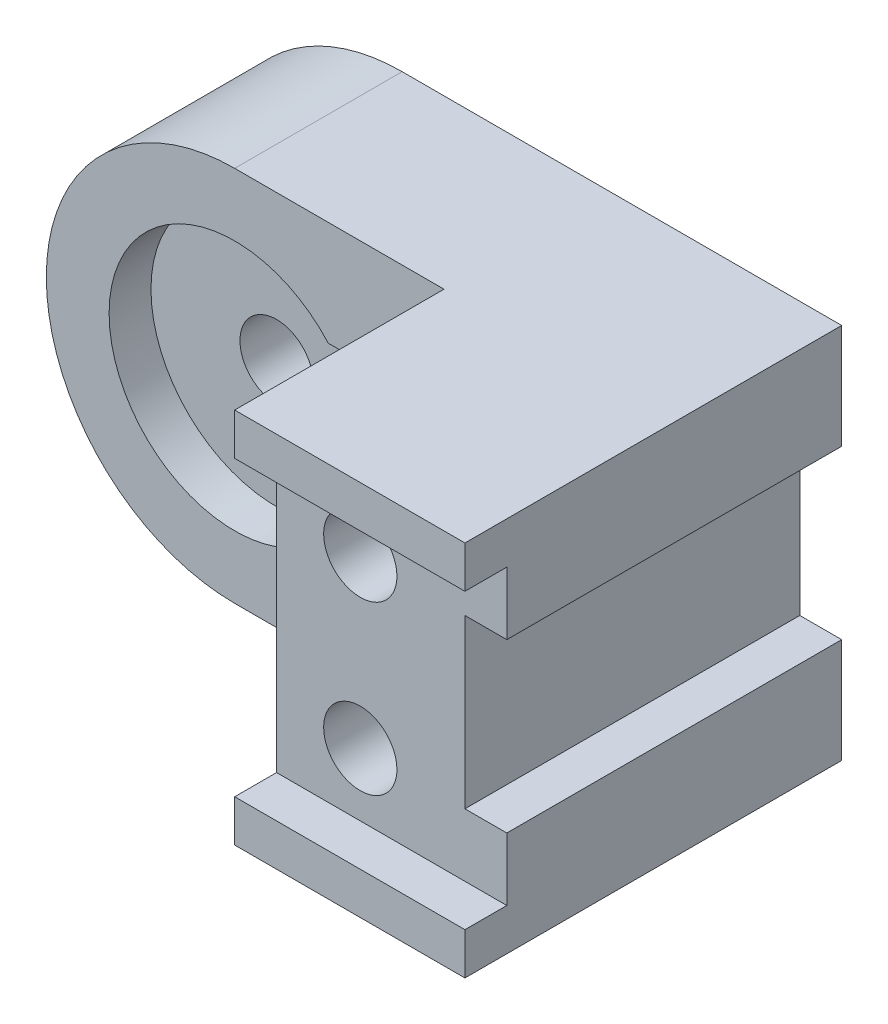
ISO-10303-21;
HEADER;
FILE_DESCRIPTION(('STEP AP214'),'2;1');
FILE_NAME('part.step','',(''),(''),'','','');
FILE_SCHEMA(('AUTOMOTIVE_DESIGN { 1 0 10303 214 1 1 1 1 }'));
ENDSEC;
DATA;
#1=APPLICATION_CONTEXT('core data for automotive mechanical design processes');
#2=APPLICATION_PROTOCOL_DEFINITION('international standard','automotive_design',2000,#1);
#3=PRODUCT_CONTEXT('',#1,'mechanical');
#4=PRODUCT('Part','Part','',(#3));
#5=PRODUCT_RELATED_PRODUCT_CATEGORY('part','',(#4));
#6=PRODUCT_DEFINITION_FORMATION('','',#4);
#7=PRODUCT_DEFINITION_CONTEXT('part definition',#1,'design');
#8=PRODUCT_DEFINITION('design','',#6,#7);
#9=PRODUCT_DEFINITION_SHAPE('','',#8);
#10=(LENGTH_UNIT() NAMED_UNIT(*) SI_UNIT(.MILLI.,.METRE.));
#11=(NAMED_UNIT(*) PLANE_ANGLE_UNIT() SI_UNIT($,.RADIAN.));
#12=(NAMED_UNIT(*) SI_UNIT($,.STERADIAN.) SOLID_ANGLE_UNIT());
#13=UNCERTAINTY_MEASURE_WITH_UNIT(LENGTH_MEASURE(1.E-05),#10,'distance_accuracy_value','');
#14=(GEOMETRIC_REPRESENTATION_CONTEXT(3) GLOBAL_UNCERTAINTY_ASSIGNED_CONTEXT((#13)) GLOBAL_UNIT_ASSIGNED_CONTEXT((#10,
#11,#12)) REPRESENTATION_CONTEXT('',''));
#15=CARTESIAN_POINT('',(0.,0.,0.));
#16=DIRECTION('',(0.,0.,1.));
#17=DIRECTION('',(1.,0.,0.));
#18=AXIS2_PLACEMENT_3D('',#15,#16,#17);
#19=CARTESIAN_POINT('',(45.,45.,40.));
#20=DIRECTION('',(0.,0.,1.));
#21=DIRECTION('',(1.,0.,0.));
#22=AXIS2_PLACEMENT_3D('',#19,#20,#21);
#23=PLANE('',#22);
#24=CARTESIAN_POINT('',(45.,45.,40.));
#25=DIRECTION('',(0.,0.,1.));
#26=DIRECTION('',(1.,0.,0.));
#27=AXIS2_PLACEMENT_3D('',#24,#25,#26);
#28=CIRCLE('',#27,30.);
#29=CARTESIAN_POINT('',(67.3606797749979,65.,40.));
#30=VERTEX_POINT('',#29);
#31=CARTESIAN_POINT('',(67.3606797749979,25.,40.));
#32=VERTEX_POINT('',#31);
#33=EDGE_CURVE('E226',#30,#32,#28,.T.);
#34=ORIENTED_EDGE('',*,*,#33,.F.);
#35=DIRECTION('',(1.,0.,0.));
#36=VECTOR('',#35,1.);
#37=CARTESIAN_POINT('',(0.,65.,40.));
#38=LINE('',#37,#36);
#39=CARTESIAN_POINT('',(95.,65.,40.));
#40=VERTEX_POINT('',#39);
#41=EDGE_CURVE('E51',#30,#40,#38,.T.);
#42=ORIENTED_EDGE('',*,*,#41,.T.);
#43=DIRECTION('',(0.,1.,0.));
#44=VECTOR('',#43,1.);
#45=CARTESIAN_POINT('',(95.,90.,40.));
#46=LINE('',#45,#44);
#47=CARTESIAN_POINT('',(95.,90.,40.));
#48=VERTEX_POINT('',#47);
#49=EDGE_CURVE('E282',#40,#48,#46,.T.);
#50=ORIENTED_EDGE('',*,*,#49,.T.);
#51=DIRECTION('',(-1.,0.,0.));
#52=VECTOR('',#51,1.);
#53=CARTESIAN_POINT('',(95.,90.,40.));
#54=LINE('',#53,#52);
#55=CARTESIAN_POINT('',(45.,90.,40.));
#56=VERTEX_POINT('',#55);
#57=EDGE_CURVE('E275',#48,#56,#54,.T.);
#58=ORIENTED_EDGE('',*,*,#57,.T.);
#59=CARTESIAN_POINT('',(45.,45.,40.));
#60=DIRECTION('',(0.,0.,1.));
#61=DIRECTION('',(1.,0.,0.));
#62=AXIS2_PLACEMENT_3D('',#59,#60,#61);
#63=CIRCLE('',#62,45.);
#64=CARTESIAN_POINT('',(45.,0.,40.));
#65=VERTEX_POINT('',#64);
#66=EDGE_CURVE('E277',#56,#65,#63,.T.);
#67=ORIENTED_EDGE('',*,*,#66,.T.);
#68=DIRECTION('',(1.,0.,0.));
#69=VECTOR('',#68,1.);
#70=CARTESIAN_POINT('',(95.,0.,40.));
#71=LINE('',#70,#69);
#72=CARTESIAN_POINT('',(95.,0.,40.));
#73=VERTEX_POINT('',#72);
#74=EDGE_CURVE('E280',#65,#73,#71,.T.);
#75=ORIENTED_EDGE('',*,*,#74,.T.);
#76=CARTESIAN_POINT('',(95.,25.,40.));
#77=VERTEX_POINT('',#76);
#78=EDGE_CURVE('E283',#73,#77,#46,.T.);
#79=ORIENTED_EDGE('',*,*,#78,.T.);
#80=DIRECTION('',(-1.,0.,0.));
#81=VECTOR('',#80,1.);
#82=CARTESIAN_POINT('',(0.,25.,40.));
#83=LINE('',#82,#81);
#84=EDGE_CURVE('E216',#77,#32,#83,.T.);
#85=ORIENTED_EDGE('',*,*,#84,.T.);
#86=EDGE_LOOP('',(#34,#42,#50,#58,#67,#75,#79,#85));
#87=FACE_BOUND('',#86,.T.);
#88=ADVANCED_FACE('F35',(#87),#23,.T.);
#89=CARTESIAN_POINT('',(0.,0.,90.));
#90=DIRECTION('',(0.,0.,-1.));
#91=DIRECTION('',(-1.,0.,0.));
#92=AXIS2_PLACEMENT_3D('',#89,#90,#91);
#93=PLANE('',#92);
#94=DIRECTION('',(0.,1.,0.));
#95=VECTOR('',#94,1.);
#96=CARTESIAN_POINT('',(150.,0.,90.));
#97=LINE('',#96,#95);
#98=CARTESIAN_POINT('',(150.,0.,90.));
#99=VERTEX_POINT('',#98);
#100=CARTESIAN_POINT('',(150.,10.,90.));
#101=VERTEX_POINT('',#100);
#102=EDGE_CURVE('E358',#99,#101,#97,.T.);
#103=ORIENTED_EDGE('',*,*,#102,.T.);
#104=DIRECTION('',(-1.,0.,0.));
#105=VECTOR('',#104,1.);
#106=CARTESIAN_POINT('',(189.,10.,90.));
#107=LINE('',#106,#105);
#108=CARTESIAN_POINT('',(95.,10.,90.));
#109=VERTEX_POINT('',#108);
#110=EDGE_CURVE('E245',#101,#109,#107,.T.);
#111=ORIENTED_EDGE('',*,*,#110,.T.);
#112=DIRECTION('',(0.,1.,0.));
#113=VECTOR('',#112,1.);
#114=CARTESIAN_POINT('',(95.,90.,90.));
#115=LINE('',#114,#113);
#116=CARTESIAN_POINT('',(95.,0.,90.));
#117=VERTEX_POINT('',#116);
#118=EDGE_CURVE('E278',#117,#109,#115,.T.);
#119=ORIENTED_EDGE('',*,*,#118,.F.);
#120=DIRECTION('',(1.,0.,0.));
#121=VECTOR('',#120,1.);
#122=CARTESIAN_POINT('',(0.,0.,90.));
#123=LINE('',#122,#121);
#124=EDGE_CURVE('E354',#117,#99,#123,.T.);
#125=ORIENTED_EDGE('',*,*,#124,.T.);
#126=EDGE_LOOP('',(#103,#111,#119,#125));
#127=FACE_BOUND('',#126,.T.);
#128=ADVANCED_FACE('F453',(#127),#93,.F.);
#129=CARTESIAN_POINT('',(45.,45.,0.));
#130=DIRECTION('',(0.,0.,1.));
#131=DIRECTION('',(1.,0.,0.));
#132=AXIS2_PLACEMENT_3D('',#129,#130,#131);
#133=CYLINDRICAL_SURFACE('',#132,45.);
#134=DIRECTION('',(0.,0.,1.));
#135=VECTOR('',#134,1.);
#136=CARTESIAN_POINT('',(45.,0.,0.));
#137=LINE('',#136,#135);
#138=CARTESIAN_POINT('',(45.,0.,0.));
#139=VERTEX_POINT('',#138);
#140=EDGE_CURVE('E316',#139,#65,#137,.T.);
#141=ORIENTED_EDGE('',*,*,#140,.T.);
#142=ORIENTED_EDGE('',*,*,#66,.F.);
#143=DIRECTION('',(0.,0.,1.));
#144=VECTOR('',#143,1.);
#145=CARTESIAN_POINT('',(45.,90.,0.));
#146=LINE('',#145,#144);
#147=CARTESIAN_POINT('',(45.,90.,0.));
#148=VERTEX_POINT('',#147);
#149=EDGE_CURVE('E329',#148,#56,#146,.T.);
#150=ORIENTED_EDGE('',*,*,#149,.F.);
#151=CARTESIAN_POINT('',(45.,45.,0.));
#152=DIRECTION('',(0.,0.,1.));
#153=DIRECTION('',(1.,0.,0.));
#154=AXIS2_PLACEMENT_3D('',#151,#152,#153);
#155=CIRCLE('',#154,45.);
#156=CARTESIAN_POINT('',(11.4589803375032,75.,0.));
#157=VERTEX_POINT('',#156);
#158=EDGE_CURVE('E326',#148,#157,#155,.T.);
#159=ORIENTED_EDGE('',*,*,#158,.T.);
#160=DIRECTION('',(0.,0.,-1.));
#161=VECTOR('',#160,1.);
#162=CARTESIAN_POINT('',(11.4589803375032,75.,10.));
#163=LINE('',#162,#161);
#164=CARTESIAN_POINT('',(11.4589803375032,75.,10.));
#165=VERTEX_POINT('',#164);
#166=EDGE_CURVE('E314',#165,#157,#163,.T.);
#167=ORIENTED_EDGE('',*,*,#166,.F.);
#168=CARTESIAN_POINT('',(45.,45.,10.));
#169=DIRECTION('',(0.,0.,-1.));
#170=DIRECTION('',(-1.,0.,0.));
#171=AXIS2_PLACEMENT_3D('',#168,#169,#170);
#172=CIRCLE('',#171,45.);
#173=CARTESIAN_POINT('',(11.4589803375031,15.,10.));
#174=VERTEX_POINT('',#173);
#175=EDGE_CURVE('E303',#174,#165,#172,.T.);
#176=ORIENTED_EDGE('',*,*,#175,.F.);
#177=DIRECTION('',(0.,0.,-1.));
#178=VECTOR('',#177,1.);
#179=CARTESIAN_POINT('',(11.4589803375031,15.,10.));
#180=LINE('',#179,#178);
#181=CARTESIAN_POINT('',(11.4589803375031,15.,0.));
#182=VERTEX_POINT('',#181);
#183=EDGE_CURVE('E317',#174,#182,#180,.T.);
#184=ORIENTED_EDGE('',*,*,#183,.T.);
#185=EDGE_CURVE('E325',#182,#139,#155,.T.);
#186=ORIENTED_EDGE('',*,*,#185,.T.);
#187=EDGE_LOOP('',(#141,#142,#150,#159,#167,#176,#184,#186));
#188=FACE_BOUND('',#187,.T.);
#189=ADVANCED_FACE('F388',(#188),#133,.T.);
#190=CARTESIAN_POINT('',(95.,80.,90.));
#191=VERTEX_POINT('',#190);
#192=CARTESIAN_POINT('',(95.,90.,90.));
#193=VERTEX_POINT('',#192);
#194=EDGE_CURVE('E274',#191,#193,#115,.T.);
#195=ORIENTED_EDGE('',*,*,#194,.F.);
#196=DIRECTION('',(-1.,0.,0.));
#197=VECTOR('',#196,1.);
#198=CARTESIAN_POINT('',(189.,80.,90.));
#199=LINE('',#198,#197);
#200=CARTESIAN_POINT('',(150.,80.,90.));
#201=VERTEX_POINT('',#200);
#202=EDGE_CURVE('E59',#201,#191,#199,.T.);
#203=ORIENTED_EDGE('',*,*,#202,.F.);
#204=CARTESIAN_POINT('',(150.,90.,90.));
#205=VERTEX_POINT('',#204);
#206=EDGE_CURVE('E356',#201,#205,#97,.T.);
#207=ORIENTED_EDGE('',*,*,#206,.T.);
#208=DIRECTION('',(-1.,0.,0.));
#209=VECTOR('',#208,1.);
#210=CARTESIAN_POINT('',(0.,90.,90.));
#211=LINE('',#210,#209);
#212=EDGE_CURVE('E361',#205,#193,#211,.T.);
#213=ORIENTED_EDGE('',*,*,#212,.T.);
#214=EDGE_LOOP('',(#195,#203,#207,#213));
#215=FACE_BOUND('',#214,.T.);
#216=ADVANCED_FACE('F402',(#215),#93,.F.);
#217=CARTESIAN_POINT('',(0.,0.,0.));
#218=DIRECTION('',(0.,0.,-1.));
#219=DIRECTION('',(-1.,0.,0.));
#220=AXIS2_PLACEMENT_3D('',#217,#218,#219);
#221=PLANE('',#220);
#222=DIRECTION('',(1.,0.,0.));
#223=VECTOR('',#222,1.);
#224=CARTESIAN_POINT('',(0.,75.,0.));
#225=LINE('',#224,#223);
#226=CARTESIAN_POINT('',(45.,75.,0.));
#227=VERTEX_POINT('',#226);
#228=EDGE_CURVE('E292',#157,#227,#225,.T.);
#229=ORIENTED_EDGE('',*,*,#228,.F.);
#230=ORIENTED_EDGE('',*,*,#158,.F.);
#231=DIRECTION('',(-1.,0.,0.));
#232=VECTOR('',#231,1.);
#233=CARTESIAN_POINT('',(0.,90.,0.));
#234=LINE('',#233,#232);
#235=CARTESIAN_POINT('',(150.,90.,0.));
#236=VERTEX_POINT('',#235);
#237=EDGE_CURVE('E357',#236,#148,#234,.T.);
#238=ORIENTED_EDGE('',*,*,#237,.F.);
#239=DIRECTION('',(0.,1.,0.));
#240=VECTOR('',#239,1.);
#241=CARTESIAN_POINT('',(150.,0.,0.));
#242=LINE('',#241,#240);
#243=CARTESIAN_POINT('',(150.,65.,0.));
#244=VERTEX_POINT('',#243);
#245=EDGE_CURVE('E365',#244,#236,#242,.T.);
#246=ORIENTED_EDGE('',*,*,#245,.F.);
#247=DIRECTION('',(-1.,0.,0.));
#248=VECTOR('',#247,1.);
#249=CARTESIAN_POINT('',(150.,65.,0.));
#250=LINE('',#249,#248);
#251=CARTESIAN_POINT('',(140.,65.,0.));
#252=VERTEX_POINT('',#251);
#253=EDGE_CURVE('E332',#244,#252,#250,.T.);
#254=ORIENTED_EDGE('',*,*,#253,.T.);
#255=DIRECTION('',(0.,-1.,0.));
#256=VECTOR('',#255,1.);
#257=CARTESIAN_POINT('',(140.,65.,0.));
#258=LINE('',#257,#256);
#259=CARTESIAN_POINT('',(140.,25.,0.));
#260=VERTEX_POINT('',#259);
#261=EDGE_CURVE('E335',#252,#260,#258,.T.);
#262=ORIENTED_EDGE('',*,*,#261,.T.);
#263=DIRECTION('',(1.,0.,0.));
#264=VECTOR('',#263,1.);
#265=CARTESIAN_POINT('',(150.,25.,0.));
#266=LINE('',#265,#264);
#267=CARTESIAN_POINT('',(150.,25.,0.));
#268=VERTEX_POINT('',#267);
#269=EDGE_CURVE('E338',#260,#268,#266,.T.);
#270=ORIENTED_EDGE('',*,*,#269,.T.);
#271=CARTESIAN_POINT('',(150.,0.,0.));
#272=VERTEX_POINT('',#271);
#273=EDGE_CURVE('E366',#272,#268,#242,.T.);
#274=ORIENTED_EDGE('',*,*,#273,.F.);
#275=DIRECTION('',(1.,0.,0.));
#276=VECTOR('',#275,1.);
#277=CARTESIAN_POINT('',(0.,0.,0.));
#278=LINE('',#277,#276);
#279=EDGE_CURVE('E345',#139,#272,#278,.T.);
#280=ORIENTED_EDGE('',*,*,#279,.F.);
#281=ORIENTED_EDGE('',*,*,#185,.F.);
#282=DIRECTION('',(1.,0.,0.));
#283=VECTOR('',#282,1.);
#284=CARTESIAN_POINT('',(0.,15.,0.));
#285=LINE('',#284,#283);
#286=CARTESIAN_POINT('',(45.,15.,0.));
#287=VERTEX_POINT('',#286);
#288=EDGE_CURVE('E298',#182,#287,#285,.T.);
#289=ORIENTED_EDGE('',*,*,#288,.T.);
#290=CARTESIAN_POINT('',(45.,45.,0.));
#291=DIRECTION('',(0.,0.,-1.));
#292=DIRECTION('',(-1.,0.,0.));
#293=AXIS2_PLACEMENT_3D('',#290,#291,#292);
#294=CIRCLE('',#293,30.);
#295=EDGE_CURVE('E309',#227,#287,#294,.T.);
#296=ORIENTED_EDGE('',*,*,#295,.F.);
#297=EDGE_LOOP('',(#229,#230,#238,#246,#254,#262,#270,#274,#280,#281,#289,#296));
#298=FACE_BOUND('',#297,.T.);
#299=ADVANCED_FACE('F384',(#298),#221,.T.);
#300=CARTESIAN_POINT('',(0.,0.,90.));
#301=DIRECTION('',(0.,1.,0.));
#302=DIRECTION('',(0.,0.,1.));
#303=AXIS2_PLACEMENT_3D('',#300,#301,#302);
#304=PLANE('',#303);
#305=ORIENTED_EDGE('',*,*,#124,.F.);
#306=DIRECTION('',(0.,0.,1.));
#307=VECTOR('',#306,1.);
#308=CARTESIAN_POINT('',(95.,0.,40.));
#309=LINE('',#308,#307);
#310=EDGE_CURVE('E286',#73,#117,#309,.T.);
#311=ORIENTED_EDGE('',*,*,#310,.F.);
#312=ORIENTED_EDGE('',*,*,#74,.F.);
#313=ORIENTED_EDGE('',*,*,#140,.F.);
#314=ORIENTED_EDGE('',*,*,#279,.T.);
#315=DIRECTION('',(0.,0.,-1.));
#316=VECTOR('',#315,1.);
#317=CARTESIAN_POINT('',(150.,0.,90.));
#318=LINE('',#317,#316);
#319=EDGE_CURVE('E11',#99,#272,#318,.T.);
#320=ORIENTED_EDGE('',*,*,#319,.F.);
#321=EDGE_LOOP('',(#305,#311,#312,#313,#314,#320));
#322=FACE_BOUND('',#321,.T.);
#323=ADVANCED_FACE('F37',(#322),#304,.F.);
#324=CARTESIAN_POINT('',(150.,0.,90.));
#325=DIRECTION('',(-1.,0.,0.));
#326=DIRECTION('',(0.,0.,1.));
#327=AXIS2_PLACEMENT_3D('',#324,#325,#326);
#328=PLANE('',#327);
#329=DIRECTION('',(0.,-1.,0.));
#330=VECTOR('',#329,1.);
#331=CARTESIAN_POINT('',(150.,0.,80.));
#332=LINE('',#331,#330);
#333=CARTESIAN_POINT('',(150.,25.,80.));
#334=VERTEX_POINT('',#333);
#335=CARTESIAN_POINT('',(150.,10.,80.));
#336=VERTEX_POINT('',#335);
#337=EDGE_CURVE('E268',#334,#336,#332,.T.);
#338=ORIENTED_EDGE('',*,*,#337,.T.);
#339=DIRECTION('',(0.,0.,1.));
#340=VECTOR('',#339,1.);
#341=CARTESIAN_POINT('',(150.,10.,90.));
#342=LINE('',#341,#340);
#343=EDGE_CURVE('E271',#336,#101,#342,.T.);
#344=ORIENTED_EDGE('',*,*,#343,.T.);
#345=ORIENTED_EDGE('',*,*,#102,.F.);
#346=ORIENTED_EDGE('',*,*,#319,.T.);
#347=ORIENTED_EDGE('',*,*,#273,.T.);
#348=DIRECTION('',(0.,0.,1.));
#349=VECTOR('',#348,1.);
#350=CARTESIAN_POINT('',(150.,25.,0.));
#351=LINE('',#350,#349);
#352=EDGE_CURVE('E342',#268,#334,#351,.T.);
#353=ORIENTED_EDGE('',*,*,#352,.T.);
#354=EDGE_LOOP('',(#338,#344,#345,#346,#347,#353));
#355=FACE_BOUND('',#354,.T.);
#356=ADVANCED_FACE('F421',(#355),#328,.F.);
#357=DIRECTION('',(0.,0.,-1.));
#358=VECTOR('',#357,1.);
#359=CARTESIAN_POINT('',(150.,80.,90.));
#360=LINE('',#359,#358);
#361=CARTESIAN_POINT('',(150.,80.,80.));
#362=VERTEX_POINT('',#361);
#363=EDGE_CURVE('E248',#201,#362,#360,.T.);
#364=ORIENTED_EDGE('',*,*,#363,.T.);
#365=DIRECTION('',(0.,-1.,0.));
#366=VECTOR('',#365,1.);
#367=CARTESIAN_POINT('',(150.,0.,80.));
#368=LINE('',#367,#366);
#369=CARTESIAN_POINT('',(150.,65.,80.));
#370=VERTEX_POINT('',#369);
#371=EDGE_CURVE('E265',#362,#370,#368,.T.);
#372=ORIENTED_EDGE('',*,*,#371,.T.);
#373=DIRECTION('',(0.,0.,1.));
#374=VECTOR('',#373,1.);
#375=CARTESIAN_POINT('',(150.,65.,0.));
#376=LINE('',#375,#374);
#377=EDGE_CURVE('E341',#244,#370,#376,.T.);
#378=ORIENTED_EDGE('',*,*,#377,.F.);
#379=ORIENTED_EDGE('',*,*,#245,.T.);
#380=DIRECTION('',(0.,0.,-1.));
#381=VECTOR('',#380,1.);
#382=CARTESIAN_POINT('',(150.,90.,90.));
#383=LINE('',#382,#381);
#384=EDGE_CURVE('E44',#205,#236,#383,.T.);
#385=ORIENTED_EDGE('',*,*,#384,.F.);
#386=ORIENTED_EDGE('',*,*,#206,.F.);
#387=EDGE_LOOP('',(#364,#372,#378,#379,#385,#386));
#388=FACE_BOUND('',#387,.T.);
#389=ADVANCED_FACE('F403',(#388),#328,.F.);
#390=CARTESIAN_POINT('',(0.,90.,90.));
#391=DIRECTION('',(0.,-1.,0.));
#392=DIRECTION('',(0.,0.,-1.));
#393=AXIS2_PLACEMENT_3D('',#390,#391,#392);
#394=PLANE('',#393);
#395=ORIENTED_EDGE('',*,*,#57,.F.);
#396=DIRECTION('',(0.,0.,1.));
#397=VECTOR('',#396,1.);
#398=CARTESIAN_POINT('',(95.,90.,40.));
#399=LINE('',#398,#397);
#400=EDGE_CURVE('E289',#48,#193,#399,.T.);
#401=ORIENTED_EDGE('',*,*,#400,.T.);
#402=ORIENTED_EDGE('',*,*,#212,.F.);
#403=ORIENTED_EDGE('',*,*,#384,.T.);
#404=ORIENTED_EDGE('',*,*,#237,.T.);
#405=ORIENTED_EDGE('',*,*,#149,.T.);
#406=EDGE_LOOP('',(#395,#401,#402,#403,#404,#405));
#407=FACE_BOUND('',#406,.T.);
#408=ADVANCED_FACE('F377',(#407),#394,.F.);
#409=CARTESIAN_POINT('',(150.,25.,0.));
#410=DIRECTION('',(0.,-1.,0.));
#411=DIRECTION('',(0.,0.,-1.));
#412=AXIS2_PLACEMENT_3D('',#409,#410,#411);
#413=PLANE('',#412);
#414=DIRECTION('',(0.,0.,1.));
#415=VECTOR('',#414,1.);
#416=CARTESIAN_POINT('',(140.,25.,0.));
#417=LINE('',#416,#415);
#418=CARTESIAN_POINT('',(140.,25.,80.));
#419=VERTEX_POINT('',#418);
#420=EDGE_CURVE('E346',#260,#419,#417,.T.);
#421=ORIENTED_EDGE('',*,*,#420,.T.);
#422=DIRECTION('',(1.,0.,0.));
#423=VECTOR('',#422,1.);
#424=CARTESIAN_POINT('',(150.,25.,80.));
#425=LINE('',#424,#423);
#426=EDGE_CURVE('E262',#419,#334,#425,.T.);
#427=ORIENTED_EDGE('',*,*,#426,.T.);
#428=ORIENTED_EDGE('',*,*,#352,.F.);
#429=ORIENTED_EDGE('',*,*,#269,.F.);
#430=EDGE_LOOP('',(#421,#427,#428,#429));
#431=FACE_BOUND('',#430,.T.);
#432=ADVANCED_FACE('F511',(#431),#413,.F.);
#433=CARTESIAN_POINT('',(140.,65.,0.));
#434=DIRECTION('',(-1.,0.,0.));
#435=DIRECTION('',(0.,0.,1.));
#436=AXIS2_PLACEMENT_3D('',#433,#434,#435);
#437=PLANE('',#436);
#438=DIRECTION('',(0.,0.,1.));
#439=VECTOR('',#438,1.);
#440=CARTESIAN_POINT('',(140.,65.,0.));
#441=LINE('',#440,#439);
#442=CARTESIAN_POINT('',(140.,65.,80.));
#443=VERTEX_POINT('',#442);
#444=EDGE_CURVE('E349',#252,#443,#441,.T.);
#445=ORIENTED_EDGE('',*,*,#444,.T.);
#446=DIRECTION('',(0.,-1.,0.));
#447=VECTOR('',#446,1.);
#448=CARTESIAN_POINT('',(140.,65.,80.));
#449=LINE('',#448,#447);
#450=EDGE_CURVE('E259',#443,#419,#449,.T.);
#451=ORIENTED_EDGE('',*,*,#450,.T.);
#452=ORIENTED_EDGE('',*,*,#420,.F.);
#453=ORIENTED_EDGE('',*,*,#261,.F.);
#454=EDGE_LOOP('',(#445,#451,#452,#453));
#455=FACE_BOUND('',#454,.T.);
#456=ADVANCED_FACE('F415',(#455),#437,.F.);
#457=CARTESIAN_POINT('',(150.,65.,0.));
#458=DIRECTION('',(0.,1.,0.));
#459=DIRECTION('',(0.,0.,1.));
#460=AXIS2_PLACEMENT_3D('',#457,#458,#459);
#461=PLANE('',#460);
#462=ORIENTED_EDGE('',*,*,#377,.T.);
#463=DIRECTION('',(-1.,0.,0.));
#464=VECTOR('',#463,1.);
#465=CARTESIAN_POINT('',(150.,65.,80.));
#466=LINE('',#465,#464);
#467=EDGE_CURVE('E256',#370,#443,#466,.T.);
#468=ORIENTED_EDGE('',*,*,#467,.T.);
#469=ORIENTED_EDGE('',*,*,#444,.F.);
#470=ORIENTED_EDGE('',*,*,#253,.F.);
#471=EDGE_LOOP('',(#462,#468,#469,#470));
#472=FACE_BOUND('',#471,.T.);
#473=ADVANCED_FACE('F413',(#472),#461,.F.);
#474=CARTESIAN_POINT('',(0.,75.,10.));
#475=DIRECTION('',(0.,1.,0.));
#476=DIRECTION('',(-1.,0.,0.));
#477=AXIS2_PLACEMENT_3D('',#474,#475,#476);
#478=PLANE('',#477);
#479=ORIENTED_EDGE('',*,*,#228,.T.);
#480=DIRECTION('',(0.,0.,-1.));
#481=VECTOR('',#480,1.);
#482=CARTESIAN_POINT('',(45.,75.,10.));
#483=LINE('',#482,#481);
#484=CARTESIAN_POINT('',(45.,75.,10.));
#485=VERTEX_POINT('',#484);
#486=EDGE_CURVE('E306',#485,#227,#483,.T.);
#487=ORIENTED_EDGE('',*,*,#486,.F.);
#488=DIRECTION('',(1.,0.,0.));
#489=VECTOR('',#488,1.);
#490=CARTESIAN_POINT('',(0.,75.,10.));
#491=LINE('',#490,#489);
#492=EDGE_CURVE('E294',#165,#485,#491,.T.);
#493=ORIENTED_EDGE('',*,*,#492,.F.);
#494=ORIENTED_EDGE('',*,*,#166,.T.);
#495=EDGE_LOOP('',(#479,#487,#493,#494));
#496=FACE_BOUND('',#495,.T.);
#497=ADVANCED_FACE('F437',(#496),#478,.F.);
#498=CARTESIAN_POINT('',(0.,15.,10.));
#499=DIRECTION('',(0.,1.,0.));
#500=DIRECTION('',(-1.,0.,0.));
#501=AXIS2_PLACEMENT_3D('',#498,#499,#500);
#502=PLANE('',#501);
#503=ORIENTED_EDGE('',*,*,#288,.F.);
#504=ORIENTED_EDGE('',*,*,#183,.F.);
#505=DIRECTION('',(1.,0.,0.));
#506=VECTOR('',#505,1.);
#507=CARTESIAN_POINT('',(0.,15.,10.));
#508=LINE('',#507,#506);
#509=CARTESIAN_POINT('',(45.,15.,10.));
#510=VERTEX_POINT('',#509);
#511=EDGE_CURVE('E301',#174,#510,#508,.T.);
#512=ORIENTED_EDGE('',*,*,#511,.T.);
#513=DIRECTION('',(0.,0.,-1.));
#514=VECTOR('',#513,1.);
#515=CARTESIAN_POINT('',(45.,15.,10.));
#516=LINE('',#515,#514);
#517=EDGE_CURVE('E320',#510,#287,#516,.T.);
#518=ORIENTED_EDGE('',*,*,#517,.T.);
#519=EDGE_LOOP('',(#503,#504,#512,#518));
#520=FACE_BOUND('',#519,.T.);
#521=ADVANCED_FACE('F431',(#520),#502,.T.);
#522=CARTESIAN_POINT('',(45.,45.,10.));
#523=DIRECTION('',(0.,0.,-1.));
#524=DIRECTION('',(-1.,0.,0.));
#525=AXIS2_PLACEMENT_3D('',#522,#523,#524);
#526=CYLINDRICAL_SURFACE('',#525,30.);
#527=ORIENTED_EDGE('',*,*,#295,.T.);
#528=ORIENTED_EDGE('',*,*,#517,.F.);
#529=CARTESIAN_POINT('',(45.,45.,10.));
#530=DIRECTION('',(0.,0.,-1.));
#531=DIRECTION('',(-1.,0.,0.));
#532=AXIS2_PLACEMENT_3D('',#529,#530,#531);
#533=CIRCLE('',#532,30.);
#534=EDGE_CURVE('E297',#485,#510,#533,.T.);
#535=ORIENTED_EDGE('',*,*,#534,.F.);
#536=ORIENTED_EDGE('',*,*,#486,.T.);
#537=EDGE_LOOP('',(#527,#528,#535,#536));
#538=FACE_BOUND('',#537,.T.);
#539=ADVANCED_FACE('F435',(#538),#526,.F.);
#540=CARTESIAN_POINT('',(0.,0.,10.));
#541=DIRECTION('',(0.,0.,-1.));
#542=DIRECTION('',(-1.,0.,0.));
#543=AXIS2_PLACEMENT_3D('',#540,#541,#542);
#544=PLANE('',#543);
#545=CARTESIAN_POINT('',(45.,45.,10.));
#546=DIRECTION('',(0.,0.,-1.));
#547=DIRECTION('',(-1.,0.,0.));
#548=AXIS2_PLACEMENT_3D('',#545,#546,#547);
#549=CIRCLE('',#548,8.74999999999999);
#550=CARTESIAN_POINT('',(36.25,45.,10.));
#551=VERTEX_POINT('',#550);
#552=EDGE_CURVE('E207',#551,#551,#549,.T.);
#553=ORIENTED_EDGE('',*,*,#552,.F.);
#554=EDGE_LOOP('',(#553));
#555=FACE_BOUND('',#554,.T.);
#556=ORIENTED_EDGE('',*,*,#492,.T.);
#557=ORIENTED_EDGE('',*,*,#534,.T.);
#558=ORIENTED_EDGE('',*,*,#511,.F.);
#559=ORIENTED_EDGE('',*,*,#175,.T.);
#560=EDGE_LOOP('',(#556,#557,#558,#559));
#561=FACE_BOUND('',#560,.T.);
#562=ADVANCED_FACE('F439',(#555,#561),#544,.T.);
#563=CARTESIAN_POINT('',(95.,90.,40.));
#564=DIRECTION('',(1.,0.,0.));
#565=DIRECTION('',(0.,1.,0.));
#566=AXIS2_PLACEMENT_3D('',#563,#564,#565);
#567=PLANE('',#566);
#568=ORIENTED_EDGE('',*,*,#118,.T.);
#569=DIRECTION('',(0.,0.,1.));
#570=VECTOR('',#569,1.);
#571=CARTESIAN_POINT('',(95.,10.,90.));
#572=LINE('',#571,#570);
#573=CARTESIAN_POINT('',(95.,10.,80.));
#574=VERTEX_POINT('',#573);
#575=EDGE_CURVE('E243',#574,#109,#572,.T.);
#576=ORIENTED_EDGE('',*,*,#575,.F.);
#577=DIRECTION('',(0.,-1.,0.));
#578=VECTOR('',#577,1.);
#579=CARTESIAN_POINT('',(95.,80.,80.));
#580=LINE('',#579,#578);
#581=CARTESIAN_POINT('',(95.,80.,80.));
#582=VERTEX_POINT('',#581);
#583=EDGE_CURVE('E240',#582,#574,#580,.T.);
#584=ORIENTED_EDGE('',*,*,#583,.F.);
#585=DIRECTION('',(0.,0.,-1.));
#586=VECTOR('',#585,1.);
#587=CARTESIAN_POINT('',(95.,80.,90.));
#588=LINE('',#587,#586);
#589=EDGE_CURVE('E233',#191,#582,#588,.T.);
#590=ORIENTED_EDGE('',*,*,#589,.F.);
#591=ORIENTED_EDGE('',*,*,#194,.T.);
#592=ORIENTED_EDGE('',*,*,#400,.F.);
#593=ORIENTED_EDGE('',*,*,#49,.F.);
#594=DIRECTION('',(0.,0.,1.));
#595=VECTOR('',#594,1.);
#596=CARTESIAN_POINT('',(95.,65.,30.));
#597=LINE('',#596,#595);
#598=CARTESIAN_POINT('',(95.,65.,30.));
#599=VERTEX_POINT('',#598);
#600=EDGE_CURVE('E231',#599,#40,#597,.T.);
#601=ORIENTED_EDGE('',*,*,#600,.F.);
#602=DIRECTION('',(0.,1.,0.));
#603=VECTOR('',#602,1.);
#604=CARTESIAN_POINT('',(95.,0.,30.));
#605=LINE('',#604,#603);
#606=CARTESIAN_POINT('',(95.,25.,30.));
#607=VERTEX_POINT('',#606);
#608=EDGE_CURVE('E221',#607,#599,#605,.T.);
#609=ORIENTED_EDGE('',*,*,#608,.F.);
#610=DIRECTION('',(0.,0.,1.));
#611=VECTOR('',#610,1.);
#612=CARTESIAN_POINT('',(95.,25.,30.));
#613=LINE('',#612,#611);
#614=EDGE_CURVE('E234',#607,#77,#613,.T.);
#615=ORIENTED_EDGE('',*,*,#614,.T.);
#616=ORIENTED_EDGE('',*,*,#78,.F.);
#617=ORIENTED_EDGE('',*,*,#310,.T.);
#618=EDGE_LOOP('',(#568,#576,#584,#590,#591,#592,#593,#601,#609,#615,#616,#617));
#619=FACE_BOUND('',#618,.T.);
#620=ADVANCED_FACE('F398',(#619),#567,.F.);
#621=CARTESIAN_POINT('',(189.,10.,90.));
#622=DIRECTION('',(0.,-1.,0.));
#623=DIRECTION('',(1.,0.,0.));
#624=AXIS2_PLACEMENT_3D('',#621,#622,#623);
#625=PLANE('',#624);
#626=DIRECTION('',(-1.,0.,0.));
#627=VECTOR('',#626,1.);
#628=CARTESIAN_POINT('',(189.,10.,80.));
#629=LINE('',#628,#627);
#630=EDGE_CURVE('E249',#336,#574,#629,.T.);
#631=ORIENTED_EDGE('',*,*,#630,.T.);
#632=ORIENTED_EDGE('',*,*,#575,.T.);
#633=ORIENTED_EDGE('',*,*,#110,.F.);
#634=ORIENTED_EDGE('',*,*,#343,.F.);
#635=EDGE_LOOP('',(#631,#632,#633,#634));
#636=FACE_BOUND('',#635,.T.);
#637=ADVANCED_FACE('F447',(#636),#625,.F.);
#638=CARTESIAN_POINT('',(189.,80.,80.));
#639=DIRECTION('',(0.,0.,-1.));
#640=DIRECTION('',(0.,1.,0.));
#641=AXIS2_PLACEMENT_3D('',#638,#639,#640);
#642=PLANE('',#641);
#643=CARTESIAN_POINT('',(115.,65.,80.));
#644=DIRECTION('',(0.,0.,1.));
#645=DIRECTION('',(0.,-1.,0.));
#646=AXIS2_PLACEMENT_3D('',#643,#644,#645);
#647=CIRCLE('',#646,8.74999999999998);
#648=CARTESIAN_POINT('',(115.,56.25,80.));
#649=VERTEX_POINT('',#648);
#650=EDGE_CURVE('E201',#649,#649,#647,.T.);
#651=ORIENTED_EDGE('',*,*,#650,.F.);
#652=EDGE_LOOP('',(#651));
#653=FACE_BOUND('',#652,.T.);
#654=CARTESIAN_POINT('',(115.,25.,80.));
#655=DIRECTION('',(0.,0.,1.));
#656=DIRECTION('',(0.,-1.,0.));
#657=AXIS2_PLACEMENT_3D('',#654,#655,#656);
#658=CIRCLE('',#657,8.74999999999998);
#659=CARTESIAN_POINT('',(115.,16.2500000000001,80.));
#660=VERTEX_POINT('',#659);
#661=EDGE_CURVE('E200',#660,#660,#658,.T.);
#662=ORIENTED_EDGE('',*,*,#661,.F.);
#663=EDGE_LOOP('',(#662));
#664=FACE_BOUND('',#663,.T.);
#665=ORIENTED_EDGE('',*,*,#426,.F.);
#666=ORIENTED_EDGE('',*,*,#450,.F.);
#667=ORIENTED_EDGE('',*,*,#467,.F.);
#668=ORIENTED_EDGE('',*,*,#371,.F.);
#669=DIRECTION('',(-1.,0.,0.));
#670=VECTOR('',#669,1.);
#671=CARTESIAN_POINT('',(189.,80.,80.));
#672=LINE('',#671,#670);
#673=EDGE_CURVE('E251',#362,#582,#672,.T.);
#674=ORIENTED_EDGE('',*,*,#673,.T.);
#675=ORIENTED_EDGE('',*,*,#583,.T.);
#676=ORIENTED_EDGE('',*,*,#630,.F.);
#677=ORIENTED_EDGE('',*,*,#337,.F.);
#678=EDGE_LOOP('',(#665,#666,#667,#668,#674,#675,#676,#677));
#679=FACE_BOUND('',#678,.T.);
#680=ADVANCED_FACE('F408',(#653,#664,#679),#642,.F.);
#681=CARTESIAN_POINT('',(189.,80.,90.));
#682=DIRECTION('',(0.,1.,0.));
#683=DIRECTION('',(-1.,0.,0.));
#684=AXIS2_PLACEMENT_3D('',#681,#682,#683);
#685=PLANE('',#684);
#686=ORIENTED_EDGE('',*,*,#202,.T.);
#687=ORIENTED_EDGE('',*,*,#589,.T.);
#688=ORIENTED_EDGE('',*,*,#673,.F.);
#689=ORIENTED_EDGE('',*,*,#363,.F.);
#690=EDGE_LOOP('',(#686,#687,#688,#689));
#691=FACE_BOUND('',#690,.T.);
#692=ADVANCED_FACE('F406',(#691),#685,.F.);
#693=CARTESIAN_POINT('',(0.,65.,30.));
#694=DIRECTION('',(0.,-1.,0.));
#695=DIRECTION('',(1.,0.,0.));
#696=AXIS2_PLACEMENT_3D('',#693,#694,#695);
#697=PLANE('',#696);
#698=ORIENTED_EDGE('',*,*,#41,.F.);
#699=DIRECTION('',(0.,0.,1.));
#700=VECTOR('',#699,1.);
#701=CARTESIAN_POINT('',(67.3606797749979,65.,30.));
#702=LINE('',#701,#700);
#703=CARTESIAN_POINT('',(67.3606797749979,65.,30.));
#704=VERTEX_POINT('',#703);
#705=EDGE_CURVE('E224',#704,#30,#702,.T.);
#706=ORIENTED_EDGE('',*,*,#705,.F.);
#707=DIRECTION('',(1.,0.,0.));
#708=VECTOR('',#707,1.);
#709=CARTESIAN_POINT('',(0.,65.,30.));
#710=LINE('',#709,#708);
#711=EDGE_CURVE('E213',#704,#599,#710,.T.);
#712=ORIENTED_EDGE('',*,*,#711,.T.);
#713=ORIENTED_EDGE('',*,*,#600,.T.);
#714=EDGE_LOOP('',(#698,#706,#712,#713));
#715=FACE_BOUND('',#714,.T.);
#716=ADVANCED_FACE('F463',(#715),#697,.T.);
#717=CARTESIAN_POINT('',(0.,25.,30.));
#718=DIRECTION('',(0.,1.,0.));
#719=DIRECTION('',(-1.,0.,0.));
#720=AXIS2_PLACEMENT_3D('',#717,#718,#719);
#721=PLANE('',#720);
#722=ORIENTED_EDGE('',*,*,#84,.F.);
#723=ORIENTED_EDGE('',*,*,#614,.F.);
#724=DIRECTION('',(-1.,0.,0.));
#725=VECTOR('',#724,1.);
#726=CARTESIAN_POINT('',(0.,25.,30.));
#727=LINE('',#726,#725);
#728=CARTESIAN_POINT('',(67.3606797749979,25.,30.));
#729=VERTEX_POINT('',#728);
#730=EDGE_CURVE('E219',#607,#729,#727,.T.);
#731=ORIENTED_EDGE('',*,*,#730,.T.);
#732=DIRECTION('',(0.,0.,1.));
#733=VECTOR('',#732,1.);
#734=CARTESIAN_POINT('',(67.3606797749979,25.,30.));
#735=LINE('',#734,#733);
#736=EDGE_CURVE('E236',#729,#32,#735,.T.);
#737=ORIENTED_EDGE('',*,*,#736,.T.);
#738=EDGE_LOOP('',(#722,#723,#731,#737));
#739=FACE_BOUND('',#738,.T.);
#740=ADVANCED_FACE('F472',(#739),#721,.T.);
#741=CARTESIAN_POINT('',(45.,45.,30.));
#742=DIRECTION('',(0.,0.,1.));
#743=DIRECTION('',(1.,0.,0.));
#744=AXIS2_PLACEMENT_3D('',#741,#742,#743);
#745=CYLINDRICAL_SURFACE('',#744,30.);
#746=ORIENTED_EDGE('',*,*,#33,.T.);
#747=ORIENTED_EDGE('',*,*,#736,.F.);
#748=CARTESIAN_POINT('',(45.,45.,30.));
#749=DIRECTION('',(0.,0.,1.));
#750=DIRECTION('',(1.,0.,0.));
#751=AXIS2_PLACEMENT_3D('',#748,#749,#750);
#752=CIRCLE('',#751,30.);
#753=EDGE_CURVE('E215',#704,#729,#752,.T.);
#754=ORIENTED_EDGE('',*,*,#753,.F.);
#755=ORIENTED_EDGE('',*,*,#705,.T.);
#756=EDGE_LOOP('',(#746,#747,#754,#755));
#757=FACE_BOUND('',#756,.T.);
#758=ADVANCED_FACE('F473',(#757),#745,.F.);
#759=CARTESIAN_POINT('',(0.,0.,30.));
#760=DIRECTION('',(0.,0.,1.));
#761=DIRECTION('',(1.,0.,0.));
#762=AXIS2_PLACEMENT_3D('',#759,#760,#761);
#763=PLANE('',#762);
#764=CARTESIAN_POINT('',(45.,45.,30.));
#765=DIRECTION('',(0.,0.,1.));
#766=DIRECTION('',(1.,0.,0.));
#767=AXIS2_PLACEMENT_3D('',#764,#765,#766);
#768=CIRCLE('',#767,8.74999999999999);
#769=CARTESIAN_POINT('',(53.75,45.,30.));
#770=VERTEX_POINT('',#769);
#771=EDGE_CURVE('E39',#770,#770,#768,.T.);
#772=ORIENTED_EDGE('',*,*,#771,.F.);
#773=EDGE_LOOP('',(#772));
#774=FACE_BOUND('',#773,.T.);
#775=ORIENTED_EDGE('',*,*,#711,.F.);
#776=ORIENTED_EDGE('',*,*,#753,.T.);
#777=ORIENTED_EDGE('',*,*,#730,.F.);
#778=ORIENTED_EDGE('',*,*,#608,.T.);
#779=EDGE_LOOP('',(#775,#776,#777,#778));
#780=FACE_BOUND('',#779,.T.);
#781=ADVANCED_FACE('F476',(#774,#780),#763,.T.);
#782=CARTESIAN_POINT('',(115.,25.,55.));
#783=DIRECTION('',(0.,0.,1.));
#784=DIRECTION('',(0.,-1.,0.));
#785=AXIS2_PLACEMENT_3D('',#782,#783,#784);
#786=CONICAL_SURFACE('',#785,8.74999999999999,1.02974425867665);
#787=CARTESIAN_POINT('',(115.,25.,49.7424695835089));
#788=VERTEX_POINT('',#787);
#789=VERTEX_LOOP('',#788);
#790=FACE_BOUND('',#789,.T.);
#791=CARTESIAN_POINT('',(115.,25.,55.));
#792=DIRECTION('',(0.,0.,1.));
#793=DIRECTION('',(0.,-1.,0.));
#794=AXIS2_PLACEMENT_3D('',#791,#792,#793);
#795=CIRCLE('',#794,8.74999999999999);
#796=CARTESIAN_POINT('',(115.,16.25,55.));
#797=VERTEX_POINT('',#796);
#798=EDGE_CURVE('E204',#797,#797,#795,.T.);
#799=ORIENTED_EDGE('',*,*,#798,.T.);
#800=EDGE_LOOP('',(#799));
#801=FACE_BOUND('',#800,.T.);
#802=ADVANCED_FACE('F483',(#790,#801),#786,.F.);
#803=CARTESIAN_POINT('',(115.,25.,80.));
#804=DIRECTION('',(0.,0.,1.));
#805=DIRECTION('',(0.,-1.,0.));
#806=AXIS2_PLACEMENT_3D('',#803,#804,#805);
#807=CYLINDRICAL_SURFACE('',#806,8.74999999999999);
#808=ORIENTED_EDGE('',*,*,#798,.F.);
#809=EDGE_LOOP('',(#808));
#810=FACE_BOUND('',#809,.T.);
#811=ORIENTED_EDGE('',*,*,#661,.T.);
#812=EDGE_LOOP('',(#811));
#813=FACE_BOUND('',#812,.T.);
#814=ADVANCED_FACE('F194',(#810,#813),#807,.F.);
#815=CARTESIAN_POINT('',(115.,65.,55.));
#816=DIRECTION('',(0.,0.,1.));
#817=DIRECTION('',(0.,-1.,0.));
#818=AXIS2_PLACEMENT_3D('',#815,#816,#817);
#819=CONICAL_SURFACE('',#818,8.74999999999999,1.02974425867665);
#820=CARTESIAN_POINT('',(115.,65.,49.7424695835089));
#821=VERTEX_POINT('',#820);
#822=VERTEX_LOOP('',#821);
#823=FACE_BOUND('',#822,.T.);
#824=CARTESIAN_POINT('',(115.,65.,55.));
#825=DIRECTION('',(0.,0.,1.));
#826=DIRECTION('',(0.,-1.,0.));
#827=AXIS2_PLACEMENT_3D('',#824,#825,#826);
#828=CIRCLE('',#827,8.74999999999999);
#829=CARTESIAN_POINT('',(115.,56.25,55.));
#830=VERTEX_POINT('',#829);
#831=EDGE_CURVE('E198',#830,#830,#828,.T.);
#832=ORIENTED_EDGE('',*,*,#831,.T.);
#833=EDGE_LOOP('',(#832));
#834=FACE_BOUND('',#833,.T.);
#835=ADVANCED_FACE('F190',(#823,#834),#819,.F.);
#836=CARTESIAN_POINT('',(115.,65.,80.));
#837=DIRECTION('',(0.,0.,1.));
#838=DIRECTION('',(0.,-1.,0.));
#839=AXIS2_PLACEMENT_3D('',#836,#837,#838);
#840=CYLINDRICAL_SURFACE('',#839,8.74999999999999);
#841=ORIENTED_EDGE('',*,*,#831,.F.);
#842=EDGE_LOOP('',(#841));
#843=FACE_BOUND('',#842,.T.);
#844=ORIENTED_EDGE('',*,*,#650,.T.);
#845=EDGE_LOOP('',(#844));
#846=FACE_BOUND('',#845,.T.);
#847=ADVANCED_FACE('F193',(#843,#846),#840,.F.);
#848=CARTESIAN_POINT('',(45.,45.,40.));
#849=DIRECTION('',(0.,0.,1.));
#850=DIRECTION('',(1.,0.,0.));
#851=AXIS2_PLACEMENT_3D('',#848,#849,#850);
#852=CYLINDRICAL_SURFACE('',#851,8.74999999999999);
#853=ORIENTED_EDGE('',*,*,#552,.T.);
#854=EDGE_LOOP('',(#853));
#855=FACE_BOUND('',#854,.T.);
#856=ORIENTED_EDGE('',*,*,#771,.T.);
#857=EDGE_LOOP('',(#856));
#858=FACE_BOUND('',#857,.T.);
#859=ADVANCED_FACE('F493',(#855,#858),#852,.F.);
#860=CLOSED_SHELL('',(#88,#128,#189,#216,#299,#323,#356,#389,#408,#432,#456,#473,#497,#521,#539,
#562,#620,#637,#680,#692,#716,#740,#758,#781,#802,#814,#835,#847,#859));
#861=MANIFOLD_SOLID_BREP('B2',#860);
#862=ADVANCED_BREP_SHAPE_REPRESENTATION('',(#18,#861),#14);
#863=SHAPE_DEFINITION_REPRESENTATION(#9,#862);
ENDSEC;
END-ISO-10303-21;
